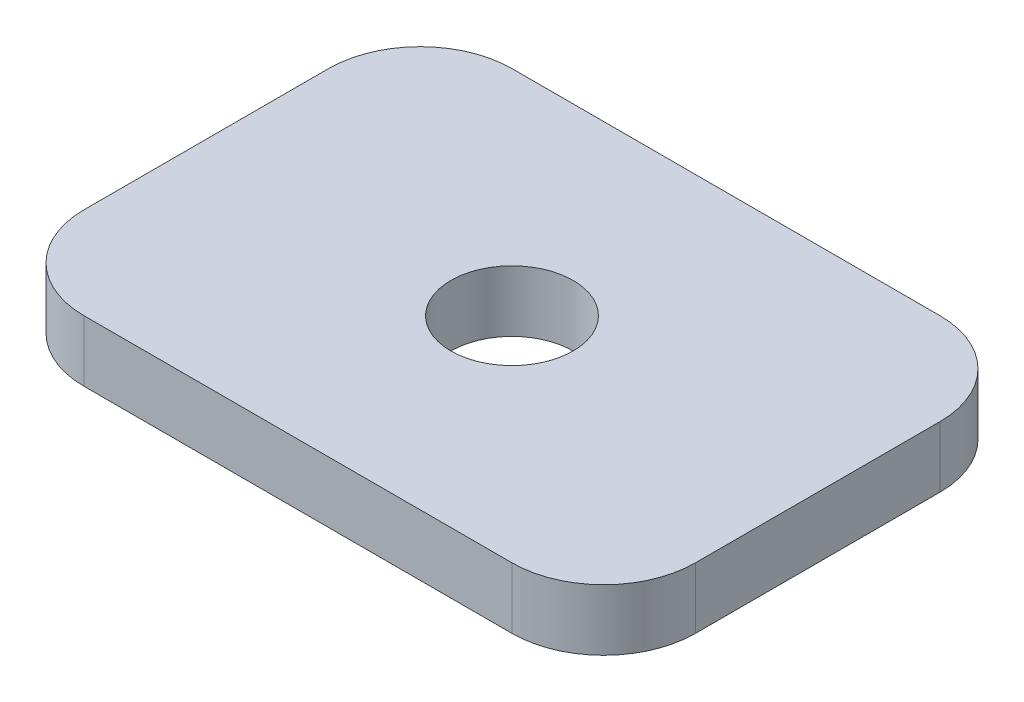
ISO-10303-21;
HEADER;
FILE_DESCRIPTION(('STEP AP214'),'2;1');
FILE_NAME('part.step','',(''),(''),'','','');
FILE_SCHEMA(('AUTOMOTIVE_DESIGN { 1 0 10303 214 1 1 1 1 }'));
ENDSEC;
DATA;
#1=APPLICATION_CONTEXT('core data for automotive mechanical design processes');
#2=APPLICATION_PROTOCOL_DEFINITION('international standard','automotive_design',2000,#1);
#3=PRODUCT_CONTEXT('',#1,'mechanical');
#4=PRODUCT('Part','Part','',(#3));
#5=PRODUCT_RELATED_PRODUCT_CATEGORY('part','',(#4));
#6=PRODUCT_DEFINITION_FORMATION('','',#4);
#7=PRODUCT_DEFINITION_CONTEXT('part definition',#1,'design');
#8=PRODUCT_DEFINITION('design','',#6,#7);
#9=PRODUCT_DEFINITION_SHAPE('','',#8);
#10=(LENGTH_UNIT() NAMED_UNIT(*) SI_UNIT(.MILLI.,.METRE.));
#11=(NAMED_UNIT(*) PLANE_ANGLE_UNIT() SI_UNIT($,.RADIAN.));
#12=(NAMED_UNIT(*) SI_UNIT($,.STERADIAN.) SOLID_ANGLE_UNIT());
#13=UNCERTAINTY_MEASURE_WITH_UNIT(LENGTH_MEASURE(1.E-05),#10,'distance_accuracy_value','');
#14=(GEOMETRIC_REPRESENTATION_CONTEXT(3) GLOBAL_UNCERTAINTY_ASSIGNED_CONTEXT((#13)) GLOBAL_UNIT_ASSIGNED_CONTEXT((#10,
#11,#12)) REPRESENTATION_CONTEXT('',''));
#15=CARTESIAN_POINT('',(0.,0.,0.));
#16=DIRECTION('',(0.,0.,1.));
#17=DIRECTION('',(1.,0.,0.));
#18=AXIS2_PLACEMENT_3D('',#15,#16,#17);
#19=CARTESIAN_POINT('',(-50.,10.,35.));
#20=DIRECTION('',(1.,0.,0.));
#21=DIRECTION('',(0.,0.,-1.));
#22=AXIS2_PLACEMENT_3D('',#19,#20,#21);
#23=PLANE('',#22);
#24=DIRECTION('',(0.,0.,1.));
#25=VECTOR('',#24,1.);
#26=CARTESIAN_POINT('',(-50.,0.,35.));
#27=LINE('',#26,#25);
#28=CARTESIAN_POINT('',(-50.,0.,-20.));
#29=VERTEX_POINT('',#28);
#30=CARTESIAN_POINT('',(-50.,0.,20.));
#31=VERTEX_POINT('',#30);
#32=EDGE_CURVE('E146',#29,#31,#27,.T.);
#33=ORIENTED_EDGE('',*,*,#32,.T.);
#34=DIRECTION('',(0.,-1.,0.));
#35=VECTOR('',#34,1.);
#36=CARTESIAN_POINT('',(-50.,10.,20.));
#37=LINE('',#36,#35);
#38=CARTESIAN_POINT('',(-50.,10.,20.));
#39=VERTEX_POINT('',#38);
#40=EDGE_CURVE('E201',#31,#39,#37,.F.);
#41=ORIENTED_EDGE('',*,*,#40,.T.);
#42=DIRECTION('',(0.,0.,1.));
#43=VECTOR('',#42,1.);
#44=CARTESIAN_POINT('',(-50.,10.,35.));
#45=LINE('',#44,#43);
#46=CARTESIAN_POINT('',(-50.,10.,-20.));
#47=VERTEX_POINT('',#46);
#48=EDGE_CURVE('E150',#47,#39,#45,.T.);
#49=ORIENTED_EDGE('',*,*,#48,.F.);
#50=DIRECTION('',(0.,-1.,0.));
#51=VECTOR('',#50,1.);
#52=CARTESIAN_POINT('',(-50.,10.,-20.));
#53=LINE('',#52,#51);
#54=EDGE_CURVE('E197',#47,#29,#53,.T.);
#55=ORIENTED_EDGE('',*,*,#54,.T.);
#56=EDGE_LOOP('',(#33,#41,#49,#55));
#57=FACE_BOUND('',#56,.T.);
#58=ADVANCED_FACE('F45',(#57),#23,.F.);
#59=CARTESIAN_POINT('',(50.,10.,35.));
#60=DIRECTION('',(0.,0.,-1.));
#61=DIRECTION('',(-1.,0.,0.));
#62=AXIS2_PLACEMENT_3D('',#59,#60,#61);
#63=PLANE('',#62);
#64=DIRECTION('',(1.,0.,0.));
#65=VECTOR('',#64,1.);
#66=CARTESIAN_POINT('',(50.,10.,35.));
#67=LINE('',#66,#65);
#68=CARTESIAN_POINT('',(-35.,10.,35.));
#69=VERTEX_POINT('',#68);
#70=CARTESIAN_POINT('',(35.,10.,35.));
#71=VERTEX_POINT('',#70);
#72=EDGE_CURVE('E154',#69,#71,#67,.T.);
#73=ORIENTED_EDGE('',*,*,#72,.F.);
#74=DIRECTION('',(0.,-1.,0.));
#75=VECTOR('',#74,1.);
#76=CARTESIAN_POINT('',(-35.,10.,35.));
#77=LINE('',#76,#75);
#78=CARTESIAN_POINT('',(-35.,0.,35.));
#79=VERTEX_POINT('',#78);
#80=EDGE_CURVE('E181',#69,#79,#77,.T.);
#81=ORIENTED_EDGE('',*,*,#80,.T.);
#82=DIRECTION('',(1.,0.,0.));
#83=VECTOR('',#82,1.);
#84=CARTESIAN_POINT('',(50.,0.,35.));
#85=LINE('',#84,#83);
#86=CARTESIAN_POINT('',(35.,0.,35.));
#87=VERTEX_POINT('',#86);
#88=EDGE_CURVE('E169',#79,#87,#85,.T.);
#89=ORIENTED_EDGE('',*,*,#88,.T.);
#90=DIRECTION('',(0.,-1.,0.));
#91=VECTOR('',#90,1.);
#92=CARTESIAN_POINT('',(35.,10.,35.));
#93=LINE('',#92,#91);
#94=EDGE_CURVE('E165',#87,#71,#93,.F.);
#95=ORIENTED_EDGE('',*,*,#94,.T.);
#96=EDGE_LOOP('',(#73,#81,#89,#95));
#97=FACE_BOUND('',#96,.T.);
#98=ADVANCED_FACE('F252',(#97),#63,.F.);
#99=CARTESIAN_POINT('',(50.,10.,35.));
#100=DIRECTION('',(-1.,0.,0.));
#101=DIRECTION('',(0.,0.,1.));
#102=AXIS2_PLACEMENT_3D('',#99,#100,#101);
#103=PLANE('',#102);
#104=DIRECTION('',(0.,0.,-1.));
#105=VECTOR('',#104,1.);
#106=CARTESIAN_POINT('',(50.,10.,35.));
#107=LINE('',#106,#105);
#108=CARTESIAN_POINT('',(50.,10.,20.));
#109=VERTEX_POINT('',#108);
#110=CARTESIAN_POINT('',(50.,10.,-20.));
#111=VERTEX_POINT('',#110);
#112=EDGE_CURVE('E159',#109,#111,#107,.T.);
#113=ORIENTED_EDGE('',*,*,#112,.F.);
#114=DIRECTION('',(0.,-1.,0.));
#115=VECTOR('',#114,1.);
#116=CARTESIAN_POINT('',(50.,10.,20.));
#117=LINE('',#116,#115);
#118=CARTESIAN_POINT('',(50.,0.,20.));
#119=VERTEX_POINT('',#118);
#120=EDGE_CURVE('E218',#109,#119,#117,.T.);
#121=ORIENTED_EDGE('',*,*,#120,.T.);
#122=DIRECTION('',(0.,0.,-1.));
#123=VECTOR('',#122,1.);
#124=CARTESIAN_POINT('',(50.,0.,35.));
#125=LINE('',#124,#123);
#126=CARTESIAN_POINT('',(50.,0.,-20.));
#127=VERTEX_POINT('',#126);
#128=EDGE_CURVE('E173',#119,#127,#125,.T.);
#129=ORIENTED_EDGE('',*,*,#128,.T.);
#130=DIRECTION('',(0.,-1.,0.));
#131=VECTOR('',#130,1.);
#132=CARTESIAN_POINT('',(50.,10.,-20.));
#133=LINE('',#132,#131);
#134=EDGE_CURVE('E215',#127,#111,#133,.F.);
#135=ORIENTED_EDGE('',*,*,#134,.T.);
#136=EDGE_LOOP('',(#113,#121,#129,#135));
#137=FACE_BOUND('',#136,.T.);
#138=ADVANCED_FACE('F226',(#137),#103,.F.);
#139=CARTESIAN_POINT('',(50.,10.,-35.));
#140=DIRECTION('',(0.,0.,1.));
#141=DIRECTION('',(1.,0.,0.));
#142=AXIS2_PLACEMENT_3D('',#139,#140,#141);
#143=PLANE('',#142);
#144=DIRECTION('',(-1.,0.,0.));
#145=VECTOR('',#144,1.);
#146=CARTESIAN_POINT('',(50.,10.,-35.));
#147=LINE('',#146,#145);
#148=CARTESIAN_POINT('',(35.,10.,-35.));
#149=VERTEX_POINT('',#148);
#150=CARTESIAN_POINT('',(-35.,10.,-35.));
#151=VERTEX_POINT('',#150);
#152=EDGE_CURVE('E162',#149,#151,#147,.T.);
#153=ORIENTED_EDGE('',*,*,#152,.F.);
#154=DIRECTION('',(0.,-1.,0.));
#155=VECTOR('',#154,1.);
#156=CARTESIAN_POINT('',(35.,10.,-35.));
#157=LINE('',#156,#155);
#158=CARTESIAN_POINT('',(35.,0.,-35.));
#159=VERTEX_POINT('',#158);
#160=EDGE_CURVE('E11',#149,#159,#157,.T.);
#161=ORIENTED_EDGE('',*,*,#160,.T.);
#162=DIRECTION('',(-1.,0.,0.));
#163=VECTOR('',#162,1.);
#164=CARTESIAN_POINT('',(50.,0.,-35.));
#165=LINE('',#164,#163);
#166=CARTESIAN_POINT('',(-35.,0.,-35.));
#167=VERTEX_POINT('',#166);
#168=EDGE_CURVE('E155',#159,#167,#165,.T.);
#169=ORIENTED_EDGE('',*,*,#168,.T.);
#170=DIRECTION('',(0.,-1.,0.));
#171=VECTOR('',#170,1.);
#172=CARTESIAN_POINT('',(-35.,10.,-35.));
#173=LINE('',#172,#171);
#174=EDGE_CURVE('E54',#167,#151,#173,.F.);
#175=ORIENTED_EDGE('',*,*,#174,.T.);
#176=EDGE_LOOP('',(#153,#161,#169,#175));
#177=FACE_BOUND('',#176,.T.);
#178=ADVANCED_FACE('F237',(#177),#143,.F.);
#179=CARTESIAN_POINT('',(0.,10.,0.));
#180=DIRECTION('',(0.,1.,0.));
#181=DIRECTION('',(0.,0.,1.));
#182=AXIS2_PLACEMENT_3D('',#179,#180,#181);
#183=PLANE('',#182);
#184=CARTESIAN_POINT('',(0.,10.,0.));
#185=DIRECTION('',(0.,1.,0.));
#186=DIRECTION('',(0.,0.,1.));
#187=AXIS2_PLACEMENT_3D('',#184,#185,#186);
#188=CIRCLE('',#187,10.);
#189=CARTESIAN_POINT('',(0.,10.,10.));
#190=VERTEX_POINT('',#189);
#191=EDGE_CURVE('E141',#190,#190,#188,.T.);
#192=ORIENTED_EDGE('',*,*,#191,.F.);
#193=EDGE_LOOP('',(#192));
#194=FACE_BOUND('',#193,.T.);
#195=ORIENTED_EDGE('',*,*,#48,.T.);
#196=CARTESIAN_POINT('',(-35.,10.,20.));
#197=DIRECTION('',(0.,1.,0.));
#198=DIRECTION('',(0.,0.,1.));
#199=AXIS2_PLACEMENT_3D('',#196,#197,#198);
#200=CIRCLE('',#199,15.);
#201=EDGE_CURVE('E212',#39,#69,#200,.T.);
#202=ORIENTED_EDGE('',*,*,#201,.T.);
#203=ORIENTED_EDGE('',*,*,#72,.T.);
#204=CARTESIAN_POINT('',(35.,10.,20.));
#205=DIRECTION('',(0.,1.,0.));
#206=DIRECTION('',(0.,0.,1.));
#207=AXIS2_PLACEMENT_3D('',#204,#205,#206);
#208=CIRCLE('',#207,15.);
#209=EDGE_CURVE('E209',#71,#109,#208,.T.);
#210=ORIENTED_EDGE('',*,*,#209,.T.);
#211=ORIENTED_EDGE('',*,*,#112,.T.);
#212=CARTESIAN_POINT('',(35.,10.,-20.));
#213=DIRECTION('',(0.,1.,0.));
#214=DIRECTION('',(0.,0.,1.));
#215=AXIS2_PLACEMENT_3D('',#212,#213,#214);
#216=CIRCLE('',#215,15.);
#217=EDGE_CURVE('E67',#111,#149,#216,.T.);
#218=ORIENTED_EDGE('',*,*,#217,.T.);
#219=ORIENTED_EDGE('',*,*,#152,.T.);
#220=CARTESIAN_POINT('',(-35.,10.,-20.));
#221=DIRECTION('',(0.,1.,0.));
#222=DIRECTION('',(0.,0.,1.));
#223=AXIS2_PLACEMENT_3D('',#220,#221,#222);
#224=CIRCLE('',#223,15.);
#225=EDGE_CURVE('E204',#151,#47,#224,.T.);
#226=ORIENTED_EDGE('',*,*,#225,.T.);
#227=EDGE_LOOP('',(#195,#202,#203,#210,#211,#218,#219,#226));
#228=FACE_BOUND('',#227,.T.);
#229=ADVANCED_FACE('F239',(#194,#228),#183,.T.);
#230=CARTESIAN_POINT('',(0.,0.,0.));
#231=DIRECTION('',(0.,1.,0.));
#232=DIRECTION('',(0.,0.,1.));
#233=AXIS2_PLACEMENT_3D('',#230,#231,#232);
#234=PLANE('',#233);
#235=CARTESIAN_POINT('',(-40.,0.,0.));
#236=DIRECTION('',(0.,-1.,0.));
#237=DIRECTION('',(0.,0.,-1.));
#238=AXIS2_PLACEMENT_3D('',#235,#236,#237);
#239=CIRCLE('',#238,1.49999999999999);
#240=CARTESIAN_POINT('',(-40.,0.,-1.5));
#241=VERTEX_POINT('',#240);
#242=EDGE_CURVE('E128',#241,#241,#239,.T.);
#243=ORIENTED_EDGE('',*,*,#242,.F.);
#244=EDGE_LOOP('',(#243));
#245=FACE_BOUND('',#244,.T.);
#246=CARTESIAN_POINT('',(40.,0.,0.));
#247=DIRECTION('',(0.,-1.,0.));
#248=DIRECTION('',(0.,0.,-1.));
#249=AXIS2_PLACEMENT_3D('',#246,#247,#248);
#250=CIRCLE('',#249,1.49999999999999);
#251=CARTESIAN_POINT('',(40.,0.,-1.49999999999997));
#252=VERTEX_POINT('',#251);
#253=EDGE_CURVE('E127',#252,#252,#250,.T.);
#254=ORIENTED_EDGE('',*,*,#253,.F.);
#255=EDGE_LOOP('',(#254));
#256=FACE_BOUND('',#255,.T.);
#257=CARTESIAN_POINT('',(0.,0.,0.));
#258=DIRECTION('',(0.,1.,0.));
#259=DIRECTION('',(0.,0.,1.));
#260=AXIS2_PLACEMENT_3D('',#257,#258,#259);
#261=CIRCLE('',#260,10.);
#262=CARTESIAN_POINT('',(0.,0.,10.));
#263=VERTEX_POINT('',#262);
#264=EDGE_CURVE('E142',#263,#263,#261,.T.);
#265=ORIENTED_EDGE('',*,*,#264,.T.);
#266=EDGE_LOOP('',(#265));
#267=FACE_BOUND('',#266,.T.);
#268=ORIENTED_EDGE('',*,*,#88,.F.);
#269=CARTESIAN_POINT('',(-35.,0.,20.));
#270=DIRECTION('',(0.,1.,0.));
#271=DIRECTION('',(0.,0.,1.));
#272=AXIS2_PLACEMENT_3D('',#269,#270,#271);
#273=CIRCLE('',#272,15.);
#274=EDGE_CURVE('E194',#79,#31,#273,.F.);
#275=ORIENTED_EDGE('',*,*,#274,.T.);
#276=ORIENTED_EDGE('',*,*,#32,.F.);
#277=CARTESIAN_POINT('',(-35.,0.,-20.));
#278=DIRECTION('',(0.,1.,0.));
#279=DIRECTION('',(0.,0.,1.));
#280=AXIS2_PLACEMENT_3D('',#277,#278,#279);
#281=CIRCLE('',#280,15.);
#282=EDGE_CURVE('E185',#29,#167,#281,.F.);
#283=ORIENTED_EDGE('',*,*,#282,.T.);
#284=ORIENTED_EDGE('',*,*,#168,.F.);
#285=CARTESIAN_POINT('',(35.,0.,-20.));
#286=DIRECTION('',(0.,1.,0.));
#287=DIRECTION('',(0.,0.,1.));
#288=AXIS2_PLACEMENT_3D('',#285,#286,#287);
#289=CIRCLE('',#288,15.);
#290=EDGE_CURVE('E188',#159,#127,#289,.F.);
#291=ORIENTED_EDGE('',*,*,#290,.T.);
#292=ORIENTED_EDGE('',*,*,#128,.F.);
#293=CARTESIAN_POINT('',(35.,0.,20.));
#294=DIRECTION('',(0.,1.,0.));
#295=DIRECTION('',(0.,0.,1.));
#296=AXIS2_PLACEMENT_3D('',#293,#294,#295);
#297=CIRCLE('',#296,15.);
#298=EDGE_CURVE('E191',#119,#87,#297,.F.);
#299=ORIENTED_EDGE('',*,*,#298,.T.);
#300=EDGE_LOOP('',(#268,#275,#276,#283,#284,#291,#292,#299));
#301=FACE_BOUND('',#300,.T.);
#302=ADVANCED_FACE('F232',(#245,#256,#267,#301),#234,.F.);
#303=CARTESIAN_POINT('',(0.,0.,0.));
#304=DIRECTION('',(0.,1.,0.));
#305=DIRECTION('',(0.,0.,1.));
#306=AXIS2_PLACEMENT_3D('',#303,#304,#305);
#307=CYLINDRICAL_SURFACE('',#306,10.);
#308=ORIENTED_EDGE('',*,*,#264,.F.);
#309=EDGE_LOOP('',(#308));
#310=FACE_BOUND('',#309,.T.);
#311=ORIENTED_EDGE('',*,*,#191,.T.);
#312=EDGE_LOOP('',(#311));
#313=FACE_BOUND('',#312,.T.);
#314=ADVANCED_FACE('F276',(#310,#313),#307,.F.);
#315=CARTESIAN_POINT('',(40.,5.,0.));
#316=DIRECTION('',(0.,-1.,0.));
#317=DIRECTION('',(0.,0.,-1.));
#318=AXIS2_PLACEMENT_3D('',#315,#316,#317);
#319=CONICAL_SURFACE('',#318,1.5,1.02974425867665);
#320=CARTESIAN_POINT('',(40.,5.90129092854134,0.));
#321=VERTEX_POINT('',#320);
#322=VERTEX_LOOP('',#321);
#323=FACE_BOUND('',#322,.T.);
#324=CARTESIAN_POINT('',(40.,5.,0.));
#325=DIRECTION('',(0.,-1.,0.));
#326=DIRECTION('',(0.,0.,-1.));
#327=AXIS2_PLACEMENT_3D('',#324,#325,#326);
#328=CIRCLE('',#327,1.5);
#329=CARTESIAN_POINT('',(40.,5.,-1.49999999999999));
#330=VERTEX_POINT('',#329);
#331=EDGE_CURVE('E133',#330,#330,#328,.T.);
#332=ORIENTED_EDGE('',*,*,#331,.T.);
#333=EDGE_LOOP('',(#332));
#334=FACE_BOUND('',#333,.T.);
#335=ADVANCED_FACE('F283',(#323,#334),#319,.F.);
#336=CARTESIAN_POINT('',(40.,0.,0.));
#337=DIRECTION('',(0.,-1.,0.));
#338=DIRECTION('',(0.,0.,-1.));
#339=AXIS2_PLACEMENT_3D('',#336,#337,#338);
#340=CYLINDRICAL_SURFACE('',#339,1.49999999999999);
#341=ORIENTED_EDGE('',*,*,#331,.F.);
#342=EDGE_LOOP('',(#341));
#343=FACE_BOUND('',#342,.T.);
#344=ORIENTED_EDGE('',*,*,#253,.T.);
#345=EDGE_LOOP('',(#344));
#346=FACE_BOUND('',#345,.T.);
#347=ADVANCED_FACE('F120',(#343,#346),#340,.F.);
#348=CARTESIAN_POINT('',(-40.,5.,0.));
#349=DIRECTION('',(0.,-1.,0.));
#350=DIRECTION('',(0.,0.,-1.));
#351=AXIS2_PLACEMENT_3D('',#348,#349,#350);
#352=CONICAL_SURFACE('',#351,1.5,1.02974425867665);
#353=CARTESIAN_POINT('',(-40.,5.90129092854134,0.));
#354=VERTEX_POINT('',#353);
#355=VERTEX_LOOP('',#354);
#356=FACE_BOUND('',#355,.T.);
#357=CARTESIAN_POINT('',(-40.,5.,0.));
#358=DIRECTION('',(0.,-1.,0.));
#359=DIRECTION('',(0.,0.,-1.));
#360=AXIS2_PLACEMENT_3D('',#357,#358,#359);
#361=CIRCLE('',#360,1.5);
#362=CARTESIAN_POINT('',(-40.,5.,-1.50000000000001));
#363=VERTEX_POINT('',#362);
#364=EDGE_CURVE('E124',#363,#363,#361,.T.);
#365=ORIENTED_EDGE('',*,*,#364,.T.);
#366=EDGE_LOOP('',(#365));
#367=FACE_BOUND('',#366,.T.);
#368=ADVANCED_FACE('F116',(#356,#367),#352,.F.);
#369=CARTESIAN_POINT('',(-40.,0.,0.));
#370=DIRECTION('',(0.,-1.,0.));
#371=DIRECTION('',(0.,0.,-1.));
#372=AXIS2_PLACEMENT_3D('',#369,#370,#371);
#373=CYLINDRICAL_SURFACE('',#372,1.49999999999999);
#374=ORIENTED_EDGE('',*,*,#364,.F.);
#375=EDGE_LOOP('',(#374));
#376=FACE_BOUND('',#375,.T.);
#377=ORIENTED_EDGE('',*,*,#242,.T.);
#378=EDGE_LOOP('',(#377));
#379=FACE_BOUND('',#378,.T.);
#380=ADVANCED_FACE('F119',(#376,#379),#373,.F.);
#381=CARTESIAN_POINT('',(-35.,10.,20.));
#382=DIRECTION('',(0.,-1.,0.));
#383=DIRECTION('',(0.,0.,-1.));
#384=AXIS2_PLACEMENT_3D('',#381,#382,#383);
#385=CYLINDRICAL_SURFACE('',#384,15.);
#386=ORIENTED_EDGE('',*,*,#201,.F.);
#387=ORIENTED_EDGE('',*,*,#40,.F.);
#388=ORIENTED_EDGE('',*,*,#274,.F.);
#389=ORIENTED_EDGE('',*,*,#80,.F.);
#390=EDGE_LOOP('',(#386,#387,#388,#389));
#391=FACE_BOUND('',#390,.T.);
#392=ADVANCED_FACE('F249',(#391),#385,.T.);
#393=CARTESIAN_POINT('',(35.,10.,20.));
#394=DIRECTION('',(0.,-1.,0.));
#395=DIRECTION('',(0.,0.,-1.));
#396=AXIS2_PLACEMENT_3D('',#393,#394,#395);
#397=CYLINDRICAL_SURFACE('',#396,15.);
#398=ORIENTED_EDGE('',*,*,#209,.F.);
#399=ORIENTED_EDGE('',*,*,#94,.F.);
#400=ORIENTED_EDGE('',*,*,#298,.F.);
#401=ORIENTED_EDGE('',*,*,#120,.F.);
#402=EDGE_LOOP('',(#398,#399,#400,#401));
#403=FACE_BOUND('',#402,.T.);
#404=ADVANCED_FACE('F254',(#403),#397,.T.);
#405=CARTESIAN_POINT('',(35.,10.,-20.));
#406=DIRECTION('',(0.,-1.,0.));
#407=DIRECTION('',(0.,0.,-1.));
#408=AXIS2_PLACEMENT_3D('',#405,#406,#407);
#409=CYLINDRICAL_SURFACE('',#408,15.);
#410=ORIENTED_EDGE('',*,*,#217,.F.);
#411=ORIENTED_EDGE('',*,*,#134,.F.);
#412=ORIENTED_EDGE('',*,*,#290,.F.);
#413=ORIENTED_EDGE('',*,*,#160,.F.);
#414=EDGE_LOOP('',(#410,#411,#412,#413));
#415=FACE_BOUND('',#414,.T.);
#416=ADVANCED_FACE('F236',(#415),#409,.T.);
#417=CARTESIAN_POINT('',(-35.,10.,-20.));
#418=DIRECTION('',(0.,-1.,0.));
#419=DIRECTION('',(0.,0.,-1.));
#420=AXIS2_PLACEMENT_3D('',#417,#418,#419);
#421=CYLINDRICAL_SURFACE('',#420,15.);
#422=ORIENTED_EDGE('',*,*,#225,.F.);
#423=ORIENTED_EDGE('',*,*,#174,.F.);
#424=ORIENTED_EDGE('',*,*,#282,.F.);
#425=ORIENTED_EDGE('',*,*,#54,.F.);
#426=EDGE_LOOP('',(#422,#423,#424,#425));
#427=FACE_BOUND('',#426,.T.);
#428=ADVANCED_FACE('F47',(#427),#421,.T.);
#429=CLOSED_SHELL('',(#58,#98,#138,#178,#229,#302,#314,#335,#347,#368,#380,#392,#404,#416,#428));
#430=MANIFOLD_SOLID_BREP('B2',#429);
#431=ADVANCED_BREP_SHAPE_REPRESENTATION('',(#18,#430),#14);
#432=SHAPE_DEFINITION_REPRESENTATION(#9,#431);
ENDSEC;
END-ISO-10303-21;
